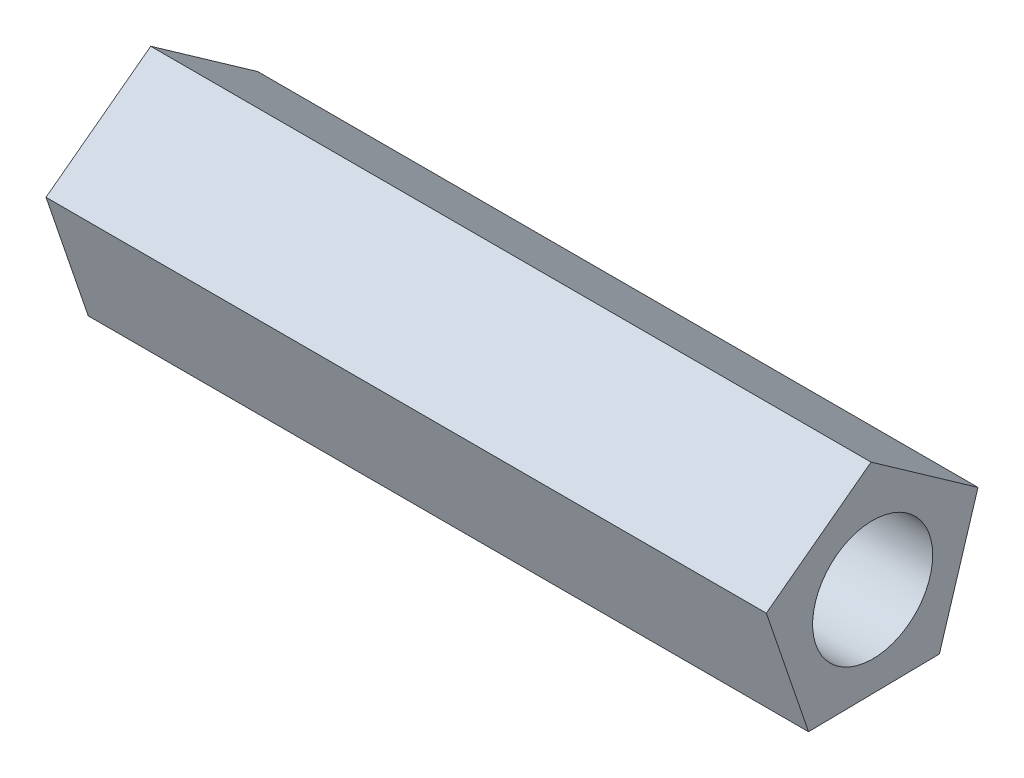
ISO-10303-21;
HEADER;
FILE_DESCRIPTION(('STEP AP214'),'2;1');
FILE_NAME('part.step','',(''),(''),'','','');
FILE_SCHEMA(('AUTOMOTIVE_DESIGN { 1 0 10303 214 1 1 1 1 }'));
ENDSEC;
DATA;
#1=APPLICATION_CONTEXT('core data for automotive mechanical design processes');
#2=APPLICATION_PROTOCOL_DEFINITION('international standard','automotive_design',2000,#1);
#3=PRODUCT_CONTEXT('',#1,'mechanical');
#4=PRODUCT('Part','Part','',(#3));
#5=PRODUCT_RELATED_PRODUCT_CATEGORY('part','',(#4));
#6=PRODUCT_DEFINITION_FORMATION('','',#4);
#7=PRODUCT_DEFINITION_CONTEXT('part definition',#1,'design');
#8=PRODUCT_DEFINITION('design','',#6,#7);
#9=PRODUCT_DEFINITION_SHAPE('','',#8);
#10=(LENGTH_UNIT() NAMED_UNIT(*) SI_UNIT(.MILLI.,.METRE.));
#11=(NAMED_UNIT(*) PLANE_ANGLE_UNIT() SI_UNIT($,.RADIAN.));
#12=(NAMED_UNIT(*) SI_UNIT($,.STERADIAN.) SOLID_ANGLE_UNIT());
#13=UNCERTAINTY_MEASURE_WITH_UNIT(LENGTH_MEASURE(1.E-05),#10,'distance_accuracy_value','');
#14=(GEOMETRIC_REPRESENTATION_CONTEXT(3) GLOBAL_UNCERTAINTY_ASSIGNED_CONTEXT((#13)) GLOBAL_UNIT_ASSIGNED_CONTEXT((#10,
#11,#12)) REPRESENTATION_CONTEXT('',''));
#15=CARTESIAN_POINT('',(0.,0.,0.));
#16=DIRECTION('',(0.,0.,1.));
#17=DIRECTION('',(1.,0.,0.));
#18=AXIS2_PLACEMENT_3D('',#15,#16,#17);
#19=CARTESIAN_POINT('',(30.,0.,0.));
#20=DIRECTION('',(1.,0.,0.));
#21=DIRECTION('',(0.,0.,-1.));
#22=AXIS2_PLACEMENT_3D('',#19,#20,#21);
#23=PLANE('',#22);
#24=DIRECTION('',(0.,0.0144825321608995,-0.999895122631473));
#25=VECTOR('',#24,1.);
#26=CARTESIAN_POINT('',(30.,-7.57812973619679,5.33987848482001));
#27=LINE('',#26,#25);
#28=CARTESIAN_POINT('',(30.,-7.57812973619679,5.33987848482001));
#29=VERTEX_POINT('',#28);
#30=CARTESIAN_POINT('',(30.,-7.42029710327531,-5.5571164672335));
#31=VERTEX_POINT('',#30);
#32=EDGE_CURVE('E119',#29,#31,#27,.T.);
#33=ORIENTED_EDGE('',*,*,#32,.T.);
#34=DIRECTION('',(0.,0.955432120549704,-0.295210878901669));
#35=VECTOR('',#34,1.);
#36=CARTESIAN_POINT('',(30.,-7.42029710327531,-5.5571164672335));
#37=LINE('',#36,#35);
#38=CARTESIAN_POINT('',(30.,2.99213391975026,-8.77436534101206));
#39=VERTEX_POINT('',#38);
#40=EDGE_CURVE('E86',#31,#39,#37,.T.);
#41=ORIENTED_EDGE('',*,*,#40,.T.);
#42=DIRECTION('',(0.,0.576006992282204,0.817444765621512));
#43=VECTOR('',#42,1.);
#44=CARTESIAN_POINT('',(30.,2.99213391975026,-8.77436534101206));
#45=LINE('',#44,#43);
#46=CARTESIAN_POINT('',(30.,9.26953756457242,0.134260456778992));
#47=VERTEX_POINT('',#46);
#48=EDGE_CURVE('E90',#39,#47,#45,.T.);
#49=ORIENTED_EDGE('',*,*,#48,.T.);
#50=DIRECTION('',(0.,-0.599440221561703,0.800419527981456));
#51=VECTOR('',#50,1.);
#52=CARTESIAN_POINT('',(30.,9.26953756457242,0.134260456778992));
#53=LINE('',#52,#51);
#54=CARTESIAN_POINT('',(30.,2.73675535514942,8.85734286664656));
#55=VERTEX_POINT('',#54);
#56=EDGE_CURVE('E94',#47,#55,#53,.T.);
#57=ORIENTED_EDGE('',*,*,#56,.T.);
#58=DIRECTION('',(0.,-0.946481423431104,-0.322758292069825));
#59=VECTOR('',#58,1.);
#60=CARTESIAN_POINT('',(30.,2.73675535514942,8.85734286664656));
#61=LINE('',#60,#59);
#62=EDGE_CURVE('E52',#55,#29,#61,.T.);
#63=ORIENTED_EDGE('',*,*,#62,.T.);
#64=EDGE_LOOP('',(#33,#41,#49,#57,#63));
#65=FACE_BOUND('',#64,.T.);
#66=CARTESIAN_POINT('',(30.,0.,0.));
#67=DIRECTION('',(1.,0.,0.));
#68=DIRECTION('',(0.,0.,-1.));
#69=AXIS2_PLACEMENT_3D('',#66,#67,#68);
#70=CIRCLE('',#69,5.);
#71=CARTESIAN_POINT('',(30.,0.,-5.));
#72=VERTEX_POINT('',#71);
#73=EDGE_CURVE('E114',#72,#72,#70,.T.);
#74=ORIENTED_EDGE('',*,*,#73,.F.);
#75=EDGE_LOOP('',(#74));
#76=FACE_BOUND('',#75,.T.);
#77=ADVANCED_FACE('F35',(#65,#76),#23,.T.);
#78=CARTESIAN_POINT('',(-30.,0.,0.));
#79=DIRECTION('',(1.,0.,0.));
#80=DIRECTION('',(0.,0.,-1.));
#81=AXIS2_PLACEMENT_3D('',#78,#79,#80);
#82=PLANE('',#81);
#83=DIRECTION('',(0.,0.0144825321608995,-0.999895122631473));
#84=VECTOR('',#83,1.);
#85=CARTESIAN_POINT('',(-30.,-7.57812973619679,5.33987848482001));
#86=LINE('',#85,#84);
#87=CARTESIAN_POINT('',(-30.,-7.57812973619679,5.33987848482001));
#88=VERTEX_POINT('',#87);
#89=CARTESIAN_POINT('',(-30.,-7.42029710327531,-5.5571164672335));
#90=VERTEX_POINT('',#89);
#91=EDGE_CURVE('E110',#88,#90,#86,.T.);
#92=ORIENTED_EDGE('',*,*,#91,.F.);
#93=DIRECTION('',(0.,-0.946481423431104,-0.322758292069825));
#94=VECTOR('',#93,1.);
#95=CARTESIAN_POINT('',(-30.,2.73675535514942,8.85734286664656));
#96=LINE('',#95,#94);
#97=CARTESIAN_POINT('',(-30.,2.73675535514942,8.85734286664656));
#98=VERTEX_POINT('',#97);
#99=EDGE_CURVE('E78',#98,#88,#96,.T.);
#100=ORIENTED_EDGE('',*,*,#99,.F.);
#101=DIRECTION('',(0.,-0.599440221561703,0.800419527981456));
#102=VECTOR('',#101,1.);
#103=CARTESIAN_POINT('',(-30.,9.26953756457242,0.134260456778992));
#104=LINE('',#103,#102);
#105=CARTESIAN_POINT('',(-30.,9.26953756457242,0.134260456778992));
#106=VERTEX_POINT('',#105);
#107=EDGE_CURVE('E72',#106,#98,#104,.T.);
#108=ORIENTED_EDGE('',*,*,#107,.F.);
#109=DIRECTION('',(0.,0.576006992282204,0.817444765621512));
#110=VECTOR('',#109,1.);
#111=CARTESIAN_POINT('',(-30.,2.99213391975026,-8.77436534101206));
#112=LINE('',#111,#110);
#113=CARTESIAN_POINT('',(-30.,2.99213391975026,-8.77436534101206));
#114=VERTEX_POINT('',#113);
#115=EDGE_CURVE('E101',#114,#106,#112,.T.);
#116=ORIENTED_EDGE('',*,*,#115,.F.);
#117=DIRECTION('',(0.,0.955432120549704,-0.295210878901669));
#118=VECTOR('',#117,1.);
#119=CARTESIAN_POINT('',(-30.,-7.42029710327531,-5.5571164672335));
#120=LINE('',#119,#118);
#121=EDGE_CURVE('E113',#90,#114,#120,.T.);
#122=ORIENTED_EDGE('',*,*,#121,.F.);
#123=EDGE_LOOP('',(#92,#100,#108,#116,#122));
#124=FACE_BOUND('',#123,.T.);
#125=CARTESIAN_POINT('',(-30.,0.,0.));
#126=DIRECTION('',(1.,0.,0.));
#127=DIRECTION('',(0.,0.,-1.));
#128=AXIS2_PLACEMENT_3D('',#125,#126,#127);
#129=CIRCLE('',#128,5.);
#130=CARTESIAN_POINT('',(-30.,0.,-5.));
#131=VERTEX_POINT('',#130);
#132=EDGE_CURVE('E199',#131,#131,#129,.T.);
#133=ORIENTED_EDGE('',*,*,#132,.T.);
#134=EDGE_LOOP('',(#133));
#135=FACE_BOUND('',#134,.T.);
#136=ADVANCED_FACE('F123',(#124,#135),#82,.F.);
#137=CARTESIAN_POINT('',(30.,-7.57812973619679,5.33987848482001));
#138=DIRECTION('',(0.,0.999895122631473,0.0144825321608995));
#139=DIRECTION('',(0.,-0.0144825321608996,0.999895122631473));
#140=AXIS2_PLACEMENT_3D('',#137,#138,#139);
#141=PLANE('',#140);
#142=ORIENTED_EDGE('',*,*,#91,.T.);
#143=DIRECTION('',(-1.,0.,0.));
#144=VECTOR('',#143,1.);
#145=CARTESIAN_POINT('',(30.,-7.42029710327531,-5.5571164672335));
#146=LINE('',#145,#144);
#147=EDGE_CURVE('E11',#31,#90,#146,.T.);
#148=ORIENTED_EDGE('',*,*,#147,.F.);
#149=ORIENTED_EDGE('',*,*,#32,.F.);
#150=DIRECTION('',(-1.,0.,0.));
#151=VECTOR('',#150,1.);
#152=CARTESIAN_POINT('',(30.,-7.57812973619679,5.33987848482001));
#153=LINE('',#152,#151);
#154=EDGE_CURVE('E106',#29,#88,#153,.T.);
#155=ORIENTED_EDGE('',*,*,#154,.T.);
#156=EDGE_LOOP('',(#142,#148,#149,#155));
#157=FACE_BOUND('',#156,.T.);
#158=ADVANCED_FACE('F37',(#157),#141,.F.);
#159=CARTESIAN_POINT('',(30.,-7.42029710327531,-5.5571164672335));
#160=DIRECTION('',(0.,0.295210878901669,0.955432120549704));
#161=DIRECTION('',(0.,-0.955432120549704,0.295210878901669));
#162=AXIS2_PLACEMENT_3D('',#159,#160,#161);
#163=PLANE('',#162);
#164=ORIENTED_EDGE('',*,*,#121,.T.);
#165=DIRECTION('',(-1.,0.,0.));
#166=VECTOR('',#165,1.);
#167=CARTESIAN_POINT('',(30.,2.99213391975026,-8.77436534101206));
#168=LINE('',#167,#166);
#169=EDGE_CURVE('E44',#39,#114,#168,.T.);
#170=ORIENTED_EDGE('',*,*,#169,.F.);
#171=ORIENTED_EDGE('',*,*,#40,.F.);
#172=ORIENTED_EDGE('',*,*,#147,.T.);
#173=EDGE_LOOP('',(#164,#170,#171,#172));
#174=FACE_BOUND('',#173,.T.);
#175=ADVANCED_FACE('F148',(#174),#163,.F.);
#176=CARTESIAN_POINT('',(30.,2.99213391975026,-8.77436534101206));
#177=DIRECTION('',(0.,-0.817444765621512,0.576006992282204));
#178=DIRECTION('',(0.,-0.576006992282204,-0.817444765621512));
#179=AXIS2_PLACEMENT_3D('',#176,#177,#178);
#180=PLANE('',#179);
#181=ORIENTED_EDGE('',*,*,#115,.T.);
#182=DIRECTION('',(-1.,0.,0.));
#183=VECTOR('',#182,1.);
#184=CARTESIAN_POINT('',(30.,9.26953756457242,0.134260456778992));
#185=LINE('',#184,#183);
#186=EDGE_CURVE('E98',#47,#106,#185,.T.);
#187=ORIENTED_EDGE('',*,*,#186,.F.);
#188=ORIENTED_EDGE('',*,*,#48,.F.);
#189=ORIENTED_EDGE('',*,*,#169,.T.);
#190=EDGE_LOOP('',(#181,#187,#188,#189));
#191=FACE_BOUND('',#190,.T.);
#192=ADVANCED_FACE('F99',(#191),#180,.F.);
#193=CARTESIAN_POINT('',(30.,9.26953756457242,0.134260456778992));
#194=DIRECTION('',(0.,-0.800419527981456,-0.599440221561703));
#195=DIRECTION('',(0.,0.599440221561703,-0.800419527981456));
#196=AXIS2_PLACEMENT_3D('',#193,#194,#195);
#197=PLANE('',#196);
#198=ORIENTED_EDGE('',*,*,#107,.T.);
#199=DIRECTION('',(-1.,0.,0.));
#200=VECTOR('',#199,1.);
#201=CARTESIAN_POINT('',(30.,2.73675535514942,8.85734286664656));
#202=LINE('',#201,#200);
#203=EDGE_CURVE('E102',#55,#98,#202,.T.);
#204=ORIENTED_EDGE('',*,*,#203,.F.);
#205=ORIENTED_EDGE('',*,*,#56,.F.);
#206=ORIENTED_EDGE('',*,*,#186,.T.);
#207=EDGE_LOOP('',(#198,#204,#205,#206));
#208=FACE_BOUND('',#207,.T.);
#209=ADVANCED_FACE('F104',(#208),#197,.F.);
#210=CARTESIAN_POINT('',(30.,2.73675535514942,8.85734286664656));
#211=DIRECTION('',(0.,0.322758292069825,-0.946481423431104));
#212=DIRECTION('',(0.,0.946481423431104,0.322758292069825));
#213=AXIS2_PLACEMENT_3D('',#210,#211,#212);
#214=PLANE('',#213);
#215=ORIENTED_EDGE('',*,*,#99,.T.);
#216=ORIENTED_EDGE('',*,*,#154,.F.);
#217=ORIENTED_EDGE('',*,*,#62,.F.);
#218=ORIENTED_EDGE('',*,*,#203,.T.);
#219=EDGE_LOOP('',(#215,#216,#217,#218));
#220=FACE_BOUND('',#219,.T.);
#221=ADVANCED_FACE('F128',(#220),#214,.F.);
#222=CARTESIAN_POINT('',(30.,0.,0.));
#223=DIRECTION('',(-1.,0.,0.));
#224=DIRECTION('',(0.,0.,1.));
#225=AXIS2_PLACEMENT_3D('',#222,#223,#224);
#226=CYLINDRICAL_SURFACE('',#225,5.);
#227=ORIENTED_EDGE('',*,*,#73,.T.);
#228=EDGE_LOOP('',(#227));
#229=FACE_BOUND('',#228,.T.);
#230=ORIENTED_EDGE('',*,*,#132,.F.);
#231=EDGE_LOOP('',(#230));
#232=FACE_BOUND('',#231,.T.);
#233=ADVANCED_FACE('F130',(#229,#232),#226,.F.);
#234=CLOSED_SHELL('',(#77,#136,#158,#175,#192,#209,#221,#233));
#235=MANIFOLD_SOLID_BREP('B2',#234);
#236=ADVANCED_BREP_SHAPE_REPRESENTATION('',(#18,#235),#14);
#237=SHAPE_DEFINITION_REPRESENTATION(#9,#236);
ENDSEC;
END-ISO-10303-21;
